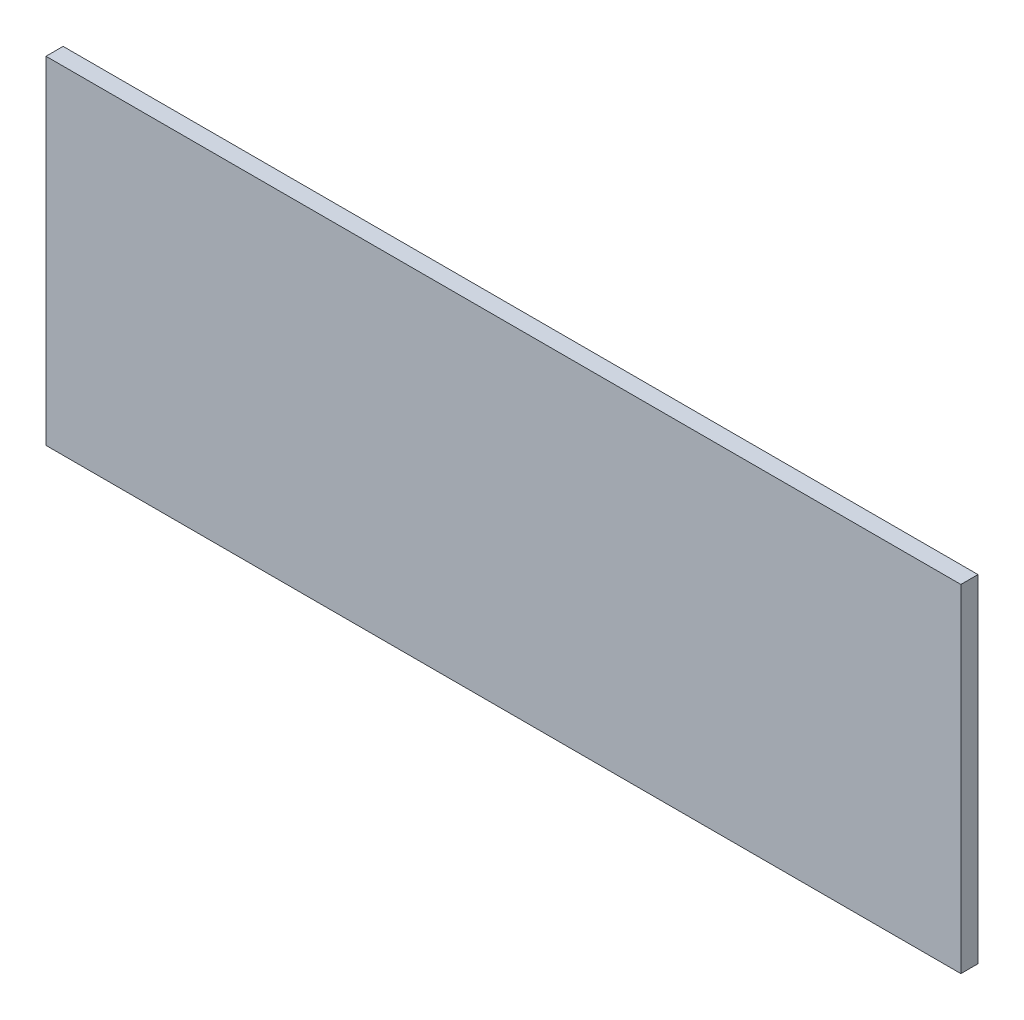
ISO-10303-21;
HEADER;
FILE_DESCRIPTION(('STEP AP214'),'2;1');
FILE_NAME('part.step','',(''),(''),'','','');
FILE_SCHEMA(('AUTOMOTIVE_DESIGN { 1 0 10303 214 1 1 1 1 }'));
ENDSEC;
DATA;
#1=APPLICATION_CONTEXT('core data for automotive mechanical design processes');
#2=APPLICATION_PROTOCOL_DEFINITION('international standard','automotive_design',2000,#1);
#3=PRODUCT_CONTEXT('',#1,'mechanical');
#4=PRODUCT('Part','Part','',(#3));
#5=PRODUCT_RELATED_PRODUCT_CATEGORY('part','',(#4));
#6=PRODUCT_DEFINITION_FORMATION('','',#4);
#7=PRODUCT_DEFINITION_CONTEXT('part definition',#1,'design');
#8=PRODUCT_DEFINITION('design','',#6,#7);
#9=PRODUCT_DEFINITION_SHAPE('','',#8);
#10=(LENGTH_UNIT() NAMED_UNIT(*) SI_UNIT(.MILLI.,.METRE.));
#11=(NAMED_UNIT(*) PLANE_ANGLE_UNIT() SI_UNIT($,.RADIAN.));
#12=(NAMED_UNIT(*) SI_UNIT($,.STERADIAN.) SOLID_ANGLE_UNIT());
#13=UNCERTAINTY_MEASURE_WITH_UNIT(LENGTH_MEASURE(1.E-05),#10,'distance_accuracy_value','');
#14=(GEOMETRIC_REPRESENTATION_CONTEXT(3) GLOBAL_UNCERTAINTY_ASSIGNED_CONTEXT((#13)) GLOBAL_UNIT_ASSIGNED_CONTEXT((#10,
#11,#12)) REPRESENTATION_CONTEXT('',''));
#15=CARTESIAN_POINT('',(0.,0.,0.));
#16=DIRECTION('',(0.,0.,1.));
#17=DIRECTION('',(1.,0.,0.));
#18=AXIS2_PLACEMENT_3D('',#15,#16,#17);
#19=CARTESIAN_POINT('',(96.5670013427734,61.3370018005371,0.));
#20=DIRECTION('',(0.,1.,0.));
#21=DIRECTION('',(1.,0.,0.));
#22=AXIS2_PLACEMENT_3D('',#19,#20,#21);
#23=PLANE('',#22);
#24=DIRECTION('',(1.,0.,0.));
#25=VECTOR('',#24,1.);
#26=CARTESIAN_POINT('',(96.5670013427734,61.3370018005371,0.03556));
#27=LINE('',#26,#25);
#28=CARTESIAN_POINT('',(96.5670013427734,61.3370018005371,0.03556));
#29=VERTEX_POINT('',#28);
#30=CARTESIAN_POINT('',(98.4670028686523,61.3370018005371,0.03556));
#31=VERTEX_POINT('',#30);
#32=EDGE_CURVE('E11',#29,#31,#27,.T.);
#33=ORIENTED_EDGE('',*,*,#32,.F.);
#34=DIRECTION('',(0.,0.,1.));
#35=VECTOR('',#34,1.);
#36=CARTESIAN_POINT('',(96.5670013427734,61.3370018005371,0.));
#37=LINE('',#36,#35);
#38=CARTESIAN_POINT('',(96.5670013427734,61.3370018005371,0.));
#39=VERTEX_POINT('',#38);
#40=EDGE_CURVE('E24',#39,#29,#37,.T.);
#41=ORIENTED_EDGE('',*,*,#40,.F.);
#42=DIRECTION('',(1.,0.,0.));
#43=VECTOR('',#42,1.);
#44=CARTESIAN_POINT('',(96.5670013427734,61.3370018005371,0.));
#45=LINE('',#44,#43);
#46=CARTESIAN_POINT('',(98.4670028686523,61.3370018005371,0.));
#47=VERTEX_POINT('',#46);
#48=EDGE_CURVE('E75',#39,#47,#45,.T.);
#49=ORIENTED_EDGE('',*,*,#48,.T.);
#50=DIRECTION('',(0.,0.,1.));
#51=VECTOR('',#50,1.);
#52=CARTESIAN_POINT('',(98.4670028686523,61.3370018005371,0.));
#53=LINE('',#52,#51);
#54=EDGE_CURVE('E37',#47,#31,#53,.T.);
#55=ORIENTED_EDGE('',*,*,#54,.T.);
#56=EDGE_LOOP('',(#33,#41,#49,#55));
#57=FACE_BOUND('',#56,.T.);
#58=ADVANCED_FACE('F17',(#57),#23,.F.);
#59=CARTESIAN_POINT('',(98.4670028686523,61.3370018005371,0.));
#60=DIRECTION('',(-1.,0.,0.));
#61=DIRECTION('',(0.,1.,0.));
#62=AXIS2_PLACEMENT_3D('',#59,#60,#61);
#63=PLANE('',#62);
#64=DIRECTION('',(0.,1.,0.));
#65=VECTOR('',#64,1.);
#66=CARTESIAN_POINT('',(98.4670028686523,61.3370018005371,0.03556));
#67=LINE('',#66,#65);
#68=CARTESIAN_POINT('',(98.4670028686523,62.0369987487793,0.03556));
#69=VERTEX_POINT('',#68);
#70=EDGE_CURVE('E83',#31,#69,#67,.T.);
#71=ORIENTED_EDGE('',*,*,#70,.F.);
#72=ORIENTED_EDGE('',*,*,#54,.F.);
#73=DIRECTION('',(0.,1.,0.));
#74=VECTOR('',#73,1.);
#75=CARTESIAN_POINT('',(98.4670028686523,61.3370018005371,0.));
#76=LINE('',#75,#74);
#77=CARTESIAN_POINT('',(98.4670028686523,62.0369987487793,0.));
#78=VERTEX_POINT('',#77);
#79=EDGE_CURVE('E81',#47,#78,#76,.T.);
#80=ORIENTED_EDGE('',*,*,#79,.T.);
#81=DIRECTION('',(0.,0.,1.));
#82=VECTOR('',#81,1.);
#83=CARTESIAN_POINT('',(98.4670028686523,62.0369987487793,0.));
#84=LINE('',#83,#82);
#85=EDGE_CURVE('E67',#78,#69,#84,.T.);
#86=ORIENTED_EDGE('',*,*,#85,.T.);
#87=EDGE_LOOP('',(#71,#72,#80,#86));
#88=FACE_BOUND('',#87,.T.);
#89=ADVANCED_FACE('F89',(#88),#63,.F.);
#90=CARTESIAN_POINT('',(98.4670028686523,62.0369987487793,0.));
#91=DIRECTION('',(0.,-1.,0.));
#92=DIRECTION('',(-1.,0.,0.));
#93=AXIS2_PLACEMENT_3D('',#90,#91,#92);
#94=PLANE('',#93);
#95=DIRECTION('',(-1.,0.,0.));
#96=VECTOR('',#95,1.);
#97=CARTESIAN_POINT('',(98.4670028686523,62.0369987487793,0.03556));
#98=LINE('',#97,#96);
#99=CARTESIAN_POINT('',(96.5670013427734,62.0369987487793,0.03556));
#100=VERTEX_POINT('',#99);
#101=EDGE_CURVE('E71',#69,#100,#98,.T.);
#102=ORIENTED_EDGE('',*,*,#101,.F.);
#103=ORIENTED_EDGE('',*,*,#85,.F.);
#104=DIRECTION('',(-1.,0.,0.));
#105=VECTOR('',#104,1.);
#106=CARTESIAN_POINT('',(98.4670028686523,62.0369987487793,0.));
#107=LINE('',#106,#105);
#108=CARTESIAN_POINT('',(96.5670013427734,62.0369987487793,0.));
#109=VERTEX_POINT('',#108);
#110=EDGE_CURVE('E63',#78,#109,#107,.T.);
#111=ORIENTED_EDGE('',*,*,#110,.T.);
#112=DIRECTION('',(0.,0.,1.));
#113=VECTOR('',#112,1.);
#114=CARTESIAN_POINT('',(96.5670013427734,62.0369987487793,0.));
#115=LINE('',#114,#113);
#116=EDGE_CURVE('E53',#109,#100,#115,.T.);
#117=ORIENTED_EDGE('',*,*,#116,.T.);
#118=EDGE_LOOP('',(#102,#103,#111,#117));
#119=FACE_BOUND('',#118,.T.);
#120=ADVANCED_FACE('F66',(#119),#94,.F.);
#121=CARTESIAN_POINT('',(96.5670013427734,62.0369987487793,0.));
#122=DIRECTION('',(1.,0.,0.));
#123=DIRECTION('',(0.,-1.,0.));
#124=AXIS2_PLACEMENT_3D('',#121,#122,#123);
#125=PLANE('',#124);
#126=DIRECTION('',(0.,-1.,0.));
#127=VECTOR('',#126,1.);
#128=CARTESIAN_POINT('',(96.5670013427734,62.0369987487793,0.03556));
#129=LINE('',#128,#127);
#130=EDGE_CURVE('E59',#100,#29,#129,.T.);
#131=ORIENTED_EDGE('',*,*,#130,.F.);
#132=ORIENTED_EDGE('',*,*,#116,.F.);
#133=DIRECTION('',(0.,-1.,0.));
#134=VECTOR('',#133,1.);
#135=CARTESIAN_POINT('',(96.5670013427734,62.0369987487793,0.));
#136=LINE('',#135,#134);
#137=EDGE_CURVE('E57',#109,#39,#136,.T.);
#138=ORIENTED_EDGE('',*,*,#137,.T.);
#139=ORIENTED_EDGE('',*,*,#40,.T.);
#140=EDGE_LOOP('',(#131,#132,#138,#139));
#141=FACE_BOUND('',#140,.T.);
#142=ADVANCED_FACE('F55',(#141),#125,.F.);
#143=CARTESIAN_POINT('',(96.5670013427734,61.3370018005371,0.));
#144=DIRECTION('',(0.,0.,-1.));
#145=DIRECTION('',(-1.,0.,0.));
#146=AXIS2_PLACEMENT_3D('',#143,#144,#145);
#147=PLANE('',#146);
#148=ORIENTED_EDGE('',*,*,#137,.F.);
#149=ORIENTED_EDGE('',*,*,#110,.F.);
#150=ORIENTED_EDGE('',*,*,#79,.F.);
#151=ORIENTED_EDGE('',*,*,#48,.F.);
#152=EDGE_LOOP('',(#148,#149,#150,#151));
#153=FACE_BOUND('',#152,.T.);
#154=ADVANCED_FACE('F74',(#153),#147,.T.);
#155=CARTESIAN_POINT('',(96.5670013427734,61.3370018005371,0.03556));
#156=DIRECTION('',(0.,0.,-1.));
#157=DIRECTION('',(-1.,0.,0.));
#158=AXIS2_PLACEMENT_3D('',#155,#156,#157);
#159=PLANE('',#158);
#160=ORIENTED_EDGE('',*,*,#32,.T.);
#161=ORIENTED_EDGE('',*,*,#70,.T.);
#162=ORIENTED_EDGE('',*,*,#101,.T.);
#163=ORIENTED_EDGE('',*,*,#130,.T.);
#164=EDGE_LOOP('',(#160,#161,#162,#163));
#165=FACE_BOUND('',#164,.T.);
#166=ADVANCED_FACE('F91',(#165),#159,.F.);
#167=CLOSED_SHELL('',(#58,#89,#120,#142,#154,#166));
#168=MANIFOLD_SOLID_BREP('B1',#167);
#169=ADVANCED_BREP_SHAPE_REPRESENTATION('',(#18,#168),#14);
#170=SHAPE_DEFINITION_REPRESENTATION(#9,#169);
ENDSEC;
END-ISO-10303-21;
